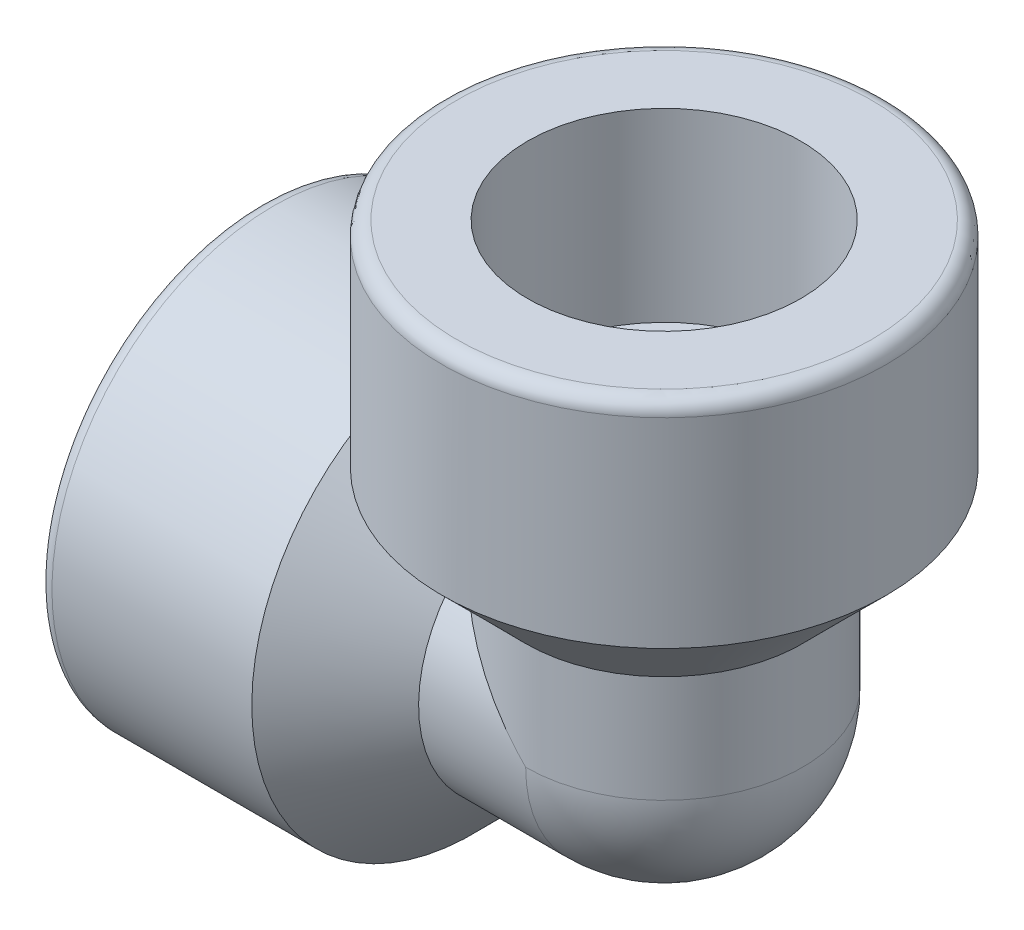
ISO-10303-21;
HEADER;
FILE_DESCRIPTION(('STEP AP214'),'2;1');
FILE_NAME('part.step','',(''),(''),'','','');
FILE_SCHEMA(('AUTOMOTIVE_DESIGN { 1 0 10303 214 1 1 1 1 }'));
ENDSEC;
DATA;
#1=APPLICATION_CONTEXT('core data for automotive mechanical design processes');
#2=APPLICATION_PROTOCOL_DEFINITION('international standard','automotive_design',2000,#1);
#3=PRODUCT_CONTEXT('',#1,'mechanical');
#4=PRODUCT('Part','Part','',(#3));
#5=PRODUCT_RELATED_PRODUCT_CATEGORY('part','',(#4));
#6=PRODUCT_DEFINITION_FORMATION('','',#4);
#7=PRODUCT_DEFINITION_CONTEXT('part definition',#1,'design');
#8=PRODUCT_DEFINITION('design','',#6,#7);
#9=PRODUCT_DEFINITION_SHAPE('','',#8);
#10=(LENGTH_UNIT() NAMED_UNIT(*) SI_UNIT(.MILLI.,.METRE.));
#11=(NAMED_UNIT(*) PLANE_ANGLE_UNIT() SI_UNIT($,.RADIAN.));
#12=(NAMED_UNIT(*) SI_UNIT($,.STERADIAN.) SOLID_ANGLE_UNIT());
#13=UNCERTAINTY_MEASURE_WITH_UNIT(LENGTH_MEASURE(1.E-05),#10,'distance_accuracy_value','');
#14=(GEOMETRIC_REPRESENTATION_CONTEXT(3) GLOBAL_UNCERTAINTY_ASSIGNED_CONTEXT((#13)) GLOBAL_UNIT_ASSIGNED_CONTEXT((#10,
#11,#12)) REPRESENTATION_CONTEXT('',''));
#15=CARTESIAN_POINT('',(0.,0.,0.));
#16=DIRECTION('',(0.,0.,1.));
#17=DIRECTION('',(1.,0.,0.));
#18=AXIS2_PLACEMENT_3D('',#15,#16,#17);
#19=CARTESIAN_POINT('',(0.,0.,0.));
#20=DIRECTION('',(1.,0.,0.));
#21=DIRECTION('',(0.,1.,0.));
#22=AXIS2_PLACEMENT_3D('',#19,#20,#21);
#23=CYLINDRICAL_SURFACE('',#22,11.557);
#24=CARTESIAN_POINT('',(-20.32635,0.,0.));
#25=DIRECTION('',(1.,0.,0.));
#26=DIRECTION('',(0.,1.,0.));
#27=AXIS2_PLACEMENT_3D('',#24,#25,#26);
#28=CIRCLE('',#27,11.557);
#29=CARTESIAN_POINT('',(-20.32635,11.557,0.));
#30=VERTEX_POINT('',#29);
#31=EDGE_CURVE('E220',#30,#30,#28,.T.);
#32=ORIENTED_EDGE('',*,*,#31,.T.);
#33=EDGE_LOOP('',(#32));
#34=FACE_BOUND('',#33,.T.);
#35=CARTESIAN_POINT('',(0.,0.,0.));
#36=DIRECTION('',(0.707106781186549,0.707106781186546,0.));
#37=DIRECTION('',(0.707106781186546,-0.707106781186549,0.));
#38=AXIS2_PLACEMENT_3D('',#35,#36,#37);
#39=ELLIPSE('',#38,16.3440661403458,11.557);
#40=CARTESIAN_POINT('',(-9.9187,9.91870000000003,-5.9315798325572));
#41=VERTEX_POINT('',#40);
#42=CARTESIAN_POINT('',(-9.9187,9.91870000000003,5.93157983255719));
#43=VERTEX_POINT('',#42);
#44=EDGE_CURVE('E84',#41,#43,#39,.T.);
#45=ORIENTED_EDGE('',*,*,#44,.F.);
#46=CARTESIAN_POINT('',(-9.9187,0.,0.));
#47=DIRECTION('',(1.,0.,0.));
#48=DIRECTION('',(0.,1.,0.));
#49=AXIS2_PLACEMENT_3D('',#46,#47,#48);
#50=CIRCLE('',#49,11.557);
#51=EDGE_CURVE('E223',#43,#41,#50,.T.);
#52=ORIENTED_EDGE('',*,*,#51,.F.);
#53=EDGE_LOOP('',(#45,#52));
#54=FACE_BOUND('',#53,.T.);
#55=ADVANCED_FACE('F70',(#34,#54),#23,.T.);
#56=CARTESIAN_POINT('',(-9.9187,0.,0.));
#57=DIRECTION('',(-1.,0.,0.));
#58=DIRECTION('',(0.,-1.,0.));
#59=AXIS2_PLACEMENT_3D('',#56,#57,#58);
#60=CONICAL_SURFACE('',#59,11.557,0.78539816339745);
#61=CARTESIAN_POINT('',(0.819150000016464,-0.819150000016481,-3.67419835772198E-06));
#62=CARTESIAN_POINT('',(0.819156269639418,-0.819156269637033,-0.0297198111189538));
#63=CARTESIAN_POINT('',(0.818341564804103,-0.818341564801315,-0.0594315481141546));
#64=CARTESIAN_POINT('',(0.815118347324884,-0.815118347322729,-0.118664130948054));
#65=CARTESIAN_POINT('',(0.812710803606909,-0.812710803605789,-0.148185081825391));
#66=CARTESIAN_POINT('',(0.806369467932354,-0.806369467932181,-0.206710310389112));
#67=CARTESIAN_POINT('',(0.802445137013405,-0.802445137013152,-0.235716647432656));
#68=CARTESIAN_POINT('',(0.793155421370217,-0.793155421369958,-0.293261594975939));
#69=CARTESIAN_POINT('',(0.78778987559809,-0.787789875597907,-0.321800152825533));
#70=CARTESIAN_POINT('',(0.770015622419365,-0.770015622419321,-0.40497565493601));
#71=CARTESIAN_POINT('',(0.755738389208463,-0.755738389208404,-0.458828652506281));
#72=CARTESIAN_POINT('',(0.722943675232962,-0.722943675232901,-0.563916811210308));
#73=CARTESIAN_POINT('',(0.704420012077311,-0.70442001207726,-0.615148020925281));
#74=CARTESIAN_POINT('',(0.665053367432766,-0.665053367432733,-0.712135568869142));
#75=CARTESIAN_POINT('',(0.644388588003857,-0.644388588003829,-0.758038171101275));
#76=CARTESIAN_POINT('',(0.60060805616887,-0.600608056168854,-0.847388735807518));
#77=CARTESIAN_POINT('',(0.577493278068745,-0.577493278068735,-0.890837663591248));
#78=CARTESIAN_POINT('',(0.504857186094345,-0.504857186094345,-1.01838017300757));
#79=CARTESIAN_POINT('',(0.452316126920789,-0.452316126920786,-1.09903670569827));
#80=CARTESIAN_POINT('',(0.34592139389584,-0.345921393895837,-1.24726431852031));
#81=CARTESIAN_POINT('',(0.292419689578086,-0.292419689578086,-1.31535670015542));
#82=CARTESIAN_POINT('',(0.182353106905065,-0.182353106905066,-1.44595214154866));
#83=CARTESIAN_POINT('',(0.125796122300498,-0.125796122300498,-1.50846859356285));
#84=CARTESIAN_POINT('',(0.00952008937551708,-0.00952008937551695,-1.62989947045198));
#85=CARTESIAN_POINT('',(-0.0502331046806778,0.0502331046806761,-1.68874785277483));
#86=CARTESIAN_POINT('',(-0.171551622961965,0.171551622961963,-1.80259962860101));
#87=CARTESIAN_POINT('',(-0.233117371607717,0.233117371607715,-1.85760211122277));
#88=CARTESIAN_POINT('',(-0.40948889915928,0.409488899159279,-2.00882392423893));
#89=CARTESIAN_POINT('',(-0.525931963692403,0.525931963692401,-2.1012195871446));
#90=CARTESIAN_POINT('',(-0.76129211758488,0.761292117584877,-2.27731269671302));
#91=CARTESIAN_POINT('',(-0.880194609565693,0.88019460956569,-2.36104985124859));
#92=CARTESIAN_POINT('',(-1.12239979641724,1.12239979641724,-2.52357003142706));
#93=CARTESIAN_POINT('',(-1.24574319585185,1.24574319585185,-2.60223109558595));
#94=CARTESIAN_POINT('',(-1.49426297891656,1.49426297891657,-2.75425245647894));
#95=CARTESIAN_POINT('',(-1.61944185711383,1.61944185711384,-2.82760453935986));
#96=CARTESIAN_POINT('',(-1.87036579396111,1.87036579396111,-2.96942187330136));
#97=CARTESIAN_POINT('',(-1.99610385663772,1.99610385663772,-3.03791198237221));
#98=CARTESIAN_POINT('',(-2.24857214089893,2.24857214089893,-3.17113933885167));
#99=CARTESIAN_POINT('',(-2.37530240672953,2.37530240672953,-3.23587641780437));
#100=CARTESIAN_POINT('',(-2.75673574200862,2.75673574200863,-3.42531229711047));
#101=CARTESIAN_POINT('',(-3.01263225618365,3.01263225618366,-3.54520854622947));
#102=CARTESIAN_POINT('',(-3.52662595753384,3.52662595753385,-3.77525417597969));
#103=CARTESIAN_POINT('',(-3.78472350373364,3.78472350373365,-3.8854019317908));
#104=CARTESIAN_POINT('',(-4.30252125377587,4.30252125377588,-4.0979206819409));
#105=CARTESIAN_POINT('',(-4.56222153228517,4.56222153228518,-4.20029131096249));
#106=CARTESIAN_POINT('',(-5.08137651785985,5.08137651785986,-4.39811172027716));
#107=CARTESIAN_POINT('',(-5.34082450501243,5.34082450501244,-4.49359694031685));
#108=CARTESIAN_POINT('',(-5.86066706418759,5.8606670641876,-4.679282766519));
#109=CARTESIAN_POINT('',(-6.12106166022858,6.1210616602286,-4.76948323758284));
#110=CARTESIAN_POINT('',(-6.90321487450145,6.90321487450147,-5.03330470259219));
#111=CARTESIAN_POINT('',(-7.42611015403457,7.42611015403458,-5.20020826852687));
#112=CARTESIAN_POINT('',(-8.09741799716953,8.09741799716955,-5.40537001663242));
#113=CARTESIAN_POINT('',(-8.24489750306851,8.24489750306854,-5.44988004888537));
#114=CARTESIAN_POINT('',(-8.54009456655671,8.54009456655673,-5.53790942822333));
#115=CARTESIAN_POINT('',(-8.68781221271166,8.68781221271168,-5.5814281840529));
#116=CARTESIAN_POINT('',(-9.54530318441663,9.54530318441666,-5.83121141271593));
#117=CARTESIAN_POINT('',(-10.2565902471213,10.2565902471213,-6.02712267853347));
#118=CARTESIAN_POINT('',(-11.6813417291102,11.6813417291103,-6.40267069692991));
#119=CARTESIAN_POINT('',(-12.3948063247732,12.3948063247732,-6.58230609295505));
#120=CARTESIAN_POINT('',(-13.8210993159182,13.8210993159183,-6.92821499503416));
#121=CARTESIAN_POINT('',(-14.5339229813901,14.5339229813901,-7.09452769389603));
#122=CARTESIAN_POINT('',(-15.9606306986241,15.9606306986242,-7.41660654573186));
#123=CARTESIAN_POINT('',(-16.6745145342454,16.6745145342454,-7.57237460900595));
#124=CARTESIAN_POINT('',(-17.388818637976,17.3888186379761,-7.72400349813519));
#125=B_SPLINE_CURVE_WITH_KNOTS('',3,(#61,#62,#63,#64,#65,#66,#67,#68,#69,#70,#71,#72,#73,#74,
#75,#76,#77,#78,#79,#80,#81,#82,#83,#84,#85,#86,#87,#88,#89,#90,#91,#92,#93,#94,#95,#96,#97,#98,
#99,#100,#101,#102,#103,#104,#105,#106,#107,#108,#109,#110,#111,#112,#113,#114,#115,#116,#117,
#118,#119,#120,#121,#122,#123,#124),.UNSPECIFIED.,.F.,.F.,(4,2,2,2,2,2,2,2,2,2,2,2,2,2,2,2,2,2,
2,2,2,2,2,2,2,2,2,2,2,2,2,4),(0.,0.0891189353022934,0.178183709224776,0.266701676384099,
0.355229539060664,0.527292916655194,0.699608410971924,0.862661040903622,1.0256490702678,
1.35382697338063,1.6589328352987,1.96328496632865,2.27208775532645,2.58096343666127,
3.1470816044846,3.71047622719119,4.28440892313418,4.85921140124149,5.43082435770936,
6.00246295136562,7.14596368571146,8.28965465434297,9.43339931275442,10.5707601215204,
11.7081499929495,13.982196056795,14.6219886402474,15.2621533375249,18.3363762022616,
21.4108550606683,24.4759291581247,27.5404464825768),.UNSPECIFIED.);
#126=CARTESIAN_POINT('',(-5.57530000000001,5.57530000000002,-4.57734146312023));
#127=VERTEX_POINT('',#126);
#128=EDGE_CURVE('E156',#127,#41,#125,.T.);
#129=ORIENTED_EDGE('',*,*,#128,.F.);
#130=CARTESIAN_POINT('',(-5.57530000000001,0.,0.));
#131=DIRECTION('',(1.,0.,0.));
#132=DIRECTION('',(0.,1.,0.));
#133=AXIS2_PLACEMENT_3D('',#130,#131,#132);
#134=CIRCLE('',#133,7.2136);
#135=CARTESIAN_POINT('',(-5.57530000000001,5.57530000000002,4.57734146312023));
#136=VERTEX_POINT('',#135);
#137=EDGE_CURVE('E129',#136,#127,#134,.T.);
#138=ORIENTED_EDGE('',*,*,#137,.F.);
#139=CARTESIAN_POINT('',(-16.0467236926674,16.0467236926675,7.43389008133731));
#140=CARTESIAN_POINT('',(-15.4158659754983,15.4158659754983,7.2947674773493));
#141=CARTESIAN_POINT('',(-14.7853953081274,14.7853953081274,7.15200573804484));
#142=CARTESIAN_POINT('',(-13.5254826259591,13.5254826259591,6.85738228857209));
#143=CARTESIAN_POINT('',(-12.8960406730512,12.8960406730512,6.70552005020596));
#144=CARTESIAN_POINT('',(-11.5709177346487,11.5709177346487,6.37397738287092));
#145=CARTESIAN_POINT('',(-10.8753904278125,10.8753904278125,6.19306148341086));
#146=CARTESIAN_POINT('',(-9.48658913164779,9.48658913164782,5.81411270705077));
#147=CARTESIAN_POINT('',(-8.79331530479206,8.79331530479209,5.61607862316274));
#148=CARTESIAN_POINT('',(-7.76918265209869,7.76918265209872,5.30571266161461));
#149=CARTESIAN_POINT('',(-7.43697980018853,7.43697980018856,5.20224682579303));
#150=CARTESIAN_POINT('',(-6.77359741677388,6.7735974167739,4.98896812587615));
#151=CARTESIAN_POINT('',(-6.44241786346557,6.44241786346559,4.87915539801272));
#152=CARTESIAN_POINT('',(-5.78141206171462,5.78141206171463,4.65191536155329));
#153=CARTESIAN_POINT('',(-5.45158562343978,5.45158562343979,4.53448916282331));
#154=CARTESIAN_POINT('',(-4.79373190953684,4.79373190953686,4.29023306572654));
#155=CARTESIAN_POINT('',(-4.46570432412057,4.46570432412058,4.16340484486831));
#156=CARTESIAN_POINT('',(-3.83430549851432,3.83430549851433,3.90677518033253));
#157=CARTESIAN_POINT('',(-3.53077560158462,3.53077560158463,3.77776355966065));
#158=CARTESIAN_POINT('',(-3.07768398647884,3.07768398647885,3.57392647165347));
#159=CARTESIAN_POINT('',(-2.92696700516343,2.92696700516344,3.5042339898758));
#160=CARTESIAN_POINT('',(-2.62649531170128,2.62649531170129,3.3608265937967));
#161=CARTESIAN_POINT('',(-2.47674056214819,2.4767405621482,3.28711183692997));
#162=CARTESIAN_POINT('',(-2.17770767410717,2.17770767410718,3.13454199198876));
#163=CARTESIAN_POINT('',(-2.02843551212798,2.02843551212798,3.05566338300983));
#164=CARTESIAN_POINT('',(-1.73150150746308,1.73150150746308,2.89208634719591));
#165=CARTESIAN_POINT('',(-1.58383949583769,1.58383949583769,2.80738853786347));
#166=CARTESIAN_POINT('',(-1.29081141706042,1.29081141706042,2.6308345101825));
#167=CARTESIAN_POINT('',(-1.14544346116887,1.14544346116887,2.5389845946275));
#168=CARTESIAN_POINT('',(-0.857809686605636,0.857809686605634,2.34607692489336));
#169=CARTESIAN_POINT('',(-0.715542679563085,0.715542679563083,2.24502277775303));
#170=CARTESIAN_POINT('',(-0.500496320398371,0.500496320398371,2.08020198777034));
#171=CARTESIAN_POINT('',(-0.426035135944628,0.42603513594463,2.02082806271226));
#172=CARTESIAN_POINT('',(-0.278956851800557,0.278956851800558,1.89785297153267));
#173=CARTESIAN_POINT('',(-0.206338113655694,0.206338113655692,1.83425575722865));
#174=CARTESIAN_POINT('',(-0.0646927160790194,0.0646927160790173,1.70300703051303));
#175=CARTESIAN_POINT('',(0.00437393228517486,-0.00437393228517498,1.6354423277687));
#176=CARTESIAN_POINT('',(0.139312572045511,-0.13931257204551,1.49417444818114));
#177=CARTESIAN_POINT('',(0.205185746611125,-0.205185746611124,1.42047357269587));
#178=CARTESIAN_POINT('',(0.303187111698328,-0.303187111698326,1.30090765077394));
#179=CARTESIAN_POINT('',(0.336961300478641,-0.336961300478638,1.25774072891856));
#180=CARTESIAN_POINT('',(0.402788029686768,-0.402788029686765,1.16885817662069));
#181=CARTESIAN_POINT('',(0.434840949493105,-0.434840949493101,1.12314311236928));
#182=CARTESIAN_POINT('',(0.496492983336969,-0.496492983336958,1.02927186169264));
#183=CARTESIAN_POINT('',(0.526111860816893,-0.526111860816876,0.981141829559768));
#184=CARTESIAN_POINT('',(0.582642764454361,-0.582642764454338,0.881709949505528));
#185=CARTESIAN_POINT('',(0.609552696063494,-0.609552696063472,0.830405696025137));
#186=CARTESIAN_POINT('',(0.661511821880377,-0.661511821880346,0.720909885490046));
#187=CARTESIAN_POINT('',(0.686320753406973,-0.686320753406931,0.662487242839695));
#188=CARTESIAN_POINT('',(0.730652514622214,-0.730652514622171,0.541837641346437));
#189=CARTESIAN_POINT('',(0.750188296336073,-0.750188296336039,0.479620472627038));
#190=CARTESIAN_POINT('',(0.774807626126006,-0.774807626125868,0.382612302394498));
#191=CARTESIAN_POINT('',(0.782320963825162,-0.782320963824967,0.349038241946078));
#192=CARTESIAN_POINT('',(0.795380463290395,-0.795380463290217,0.281132027239059));
#193=CARTESIAN_POINT('',(0.800927080496336,-0.800927080496231,0.246800050452344));
#194=CARTESIAN_POINT('',(0.809935520516454,-0.809935520515707,0.177231575886932));
#195=CARTESIAN_POINT('',(0.813375784912049,-0.813375784910579,0.141989450810301));
#196=CARTESIAN_POINT('',(0.817990699551,-0.817990699549078,0.0711695089127556));
#197=CARTESIAN_POINT('',(0.819162675493323,-0.819162675491671,0.035591345481499));
#198=CARTESIAN_POINT('',(0.819150000010504,-0.819150000010521,2.93563873496511E-06));
#199=B_SPLINE_CURVE_WITH_KNOTS('',3,(#139,#140,#141,#142,#143,#144,#145,#146,#147,#148,#149,
#150,#151,#152,#153,#154,#155,#156,#157,#158,#159,#160,#161,#162,#163,#164,#165,#166,#167,#168,
#169,#170,#171,#172,#173,#174,#175,#176,#177,#178,#179,#180,#181,#182,#183,#184,#185,#186,#187,
#188,#189,#190,#191,#192,#193,#194,#195,#196,#197,#198),.UNSPECIFIED.,.F.,.F.,(4,2,2,2,2,2,2,2,
2,2,2,2,2,2,2,2,2,2,2,2,2,2,2,2,2,2,2,2,2,4),(0.,2.70887116468708,5.41789970627266,
8.41816395385601,11.4186399202379,12.8617980673313,14.3049252494783,15.7478425283824,
17.1905029787808,18.5349776418694,19.2076975899197,19.880391226095,20.5563967767829,
21.2323307038258,21.9076755626822,22.5827568906604,22.945348067042,23.3076046142722,
23.6637315515863,24.0197255208061,24.2127896791964,24.4058111088926,24.5970669434371,
24.7884695385411,24.9925129899604,25.196050608156,25.3015969419512,25.4071188180513,
25.5137033996035,25.6204135674921),.UNSPECIFIED.);
#200=EDGE_CURVE('E91',#43,#136,#199,.T.);
#201=ORIENTED_EDGE('',*,*,#200,.F.);
#202=ORIENTED_EDGE('',*,*,#51,.T.);
#203=EDGE_LOOP('',(#129,#138,#201,#202));
#204=FACE_BOUND('',#203,.T.);
#205=ADVANCED_FACE('F162',(#204),#60,.T.);
#206=CARTESIAN_POINT('',(0.,0.,0.));
#207=DIRECTION('',(1.,0.,0.));
#208=DIRECTION('',(0.,1.,0.));
#209=AXIS2_PLACEMENT_3D('',#206,#207,#208);
#210=CYLINDRICAL_SURFACE('',#209,7.2136);
#211=CARTESIAN_POINT('',(0.,0.,0.));
#212=DIRECTION('',(0.707106781186549,0.707106781186546,0.));
#213=DIRECTION('',(0.707106781186546,-0.707106781186549,0.));
#214=AXIS2_PLACEMENT_3D('',#211,#212,#213);
#215=ELLIPSE('',#214,10.2015709535345,7.2136);
#216=CARTESIAN_POINT('',(0.,0.,-7.2136));
#217=VERTEX_POINT('',#216);
#218=EDGE_CURVE('E123',#217,#127,#215,.T.);
#219=ORIENTED_EDGE('',*,*,#218,.F.);
#220=CARTESIAN_POINT('',(0.,0.,0.));
#221=DIRECTION('',(1.,0.,0.));
#222=DIRECTION('',(0.,1.,0.));
#223=AXIS2_PLACEMENT_3D('',#220,#221,#222);
#224=CIRCLE('',#223,7.2136);
#225=CARTESIAN_POINT('',(0.,0.,7.2136));
#226=VERTEX_POINT('',#225);
#227=EDGE_CURVE('E126',#226,#217,#224,.T.);
#228=ORIENTED_EDGE('',*,*,#227,.F.);
#229=EDGE_CURVE('E112',#136,#226,#215,.T.);
#230=ORIENTED_EDGE('',*,*,#229,.F.);
#231=ORIENTED_EDGE('',*,*,#137,.T.);
#232=EDGE_LOOP('',(#219,#228,#230,#231));
#233=FACE_BOUND('',#232,.T.);
#234=ADVANCED_FACE('F127',(#233),#210,.T.);
#235=CARTESIAN_POINT('',(-21.082,-7.112,0.));
#236=DIRECTION('',(1.,0.,0.));
#237=DIRECTION('',(0.,1.,0.));
#238=AXIS2_PLACEMENT_3D('',#235,#236,#237);
#239=PLANE('',#238);
#240=CARTESIAN_POINT('',(-21.082,0.,0.));
#241=DIRECTION('',(1.,0.,0.));
#242=DIRECTION('',(0.,1.,0.));
#243=AXIS2_PLACEMENT_3D('',#240,#241,#242);
#244=CIRCLE('',#243,10.80135);
#245=CARTESIAN_POINT('',(-21.082,10.80135,0.));
#246=VERTEX_POINT('',#245);
#247=EDGE_CURVE('E78',#246,#246,#244,.T.);
#248=ORIENTED_EDGE('',*,*,#247,.F.);
#249=EDGE_LOOP('',(#248));
#250=FACE_BOUND('',#249,.T.);
#251=CARTESIAN_POINT('',(-21.082,0.,0.));
#252=DIRECTION('',(1.,0.,0.));
#253=DIRECTION('',(0.,1.,0.));
#254=AXIS2_PLACEMENT_3D('',#251,#252,#253);
#255=CIRCLE('',#254,7.112);
#256=CARTESIAN_POINT('',(-21.082,7.112,0.));
#257=VERTEX_POINT('',#256);
#258=EDGE_CURVE('E236',#257,#257,#255,.T.);
#259=ORIENTED_EDGE('',*,*,#258,.T.);
#260=EDGE_LOOP('',(#259));
#261=FACE_BOUND('',#260,.T.);
#262=ADVANCED_FACE('F72',(#250,#261),#239,.F.);
#263=CARTESIAN_POINT('',(-20.32635,0.,0.));
#264=DIRECTION('',(1.,0.,0.));
#265=DIRECTION('',(0.,1.,0.));
#266=AXIS2_PLACEMENT_3D('',#263,#264,#265);
#267=TOROIDAL_SURFACE('',#266,10.80135,0.755650000000001);
#268=ORIENTED_EDGE('',*,*,#31,.F.);
#269=EDGE_LOOP('',(#268));
#270=FACE_BOUND('',#269,.T.);
#271=ORIENTED_EDGE('',*,*,#247,.T.);
#272=EDGE_LOOP('',(#271));
#273=FACE_BOUND('',#272,.T.);
#274=ADVANCED_FACE('F201',(#270,#273),#267,.T.);
#275=CARTESIAN_POINT('',(0.,0.,0.));
#276=DIRECTION('',(1.,0.,0.));
#277=DIRECTION('',(0.,1.,0.));
#278=AXIS2_PLACEMENT_3D('',#275,#276,#277);
#279=CYLINDRICAL_SURFACE('',#278,4.191);
#280=CARTESIAN_POINT('',(0.,0.,0.));
#281=DIRECTION('',(0.707106781186549,0.707106781186546,0.));
#282=DIRECTION('',(0.707106781186546,-0.707106781186549,0.));
#283=AXIS2_PLACEMENT_3D('',#280,#281,#282);
#284=ELLIPSE('',#283,5.92696903990563,4.191);
#285=CARTESIAN_POINT('',(0.,0.,-4.191));
#286=VERTEX_POINT('',#285);
#287=CARTESIAN_POINT('',(0.,0.,4.191));
#288=VERTEX_POINT('',#287);
#289=EDGE_CURVE('E12',#286,#288,#284,.T.);
#290=ORIENTED_EDGE('',*,*,#289,.T.);
#291=CARTESIAN_POINT('',(0.,0.,0.));
#292=DIRECTION('',(1.,0.,0.));
#293=DIRECTION('',(0.,1.,0.));
#294=AXIS2_PLACEMENT_3D('',#291,#292,#293);
#295=CIRCLE('',#294,4.191);
#296=EDGE_CURVE('E130',#288,#286,#295,.T.);
#297=ORIENTED_EDGE('',*,*,#296,.T.);
#298=EDGE_LOOP('',(#290,#297));
#299=FACE_BOUND('',#298,.T.);
#300=CARTESIAN_POINT('',(-11.43,0.,0.));
#301=DIRECTION('',(1.,0.,0.));
#302=DIRECTION('',(0.,1.,0.));
#303=AXIS2_PLACEMENT_3D('',#300,#301,#302);
#304=CIRCLE('',#303,4.191);
#305=CARTESIAN_POINT('',(-11.43,4.19099999999999,0.));
#306=VERTEX_POINT('',#305);
#307=EDGE_CURVE('E230',#306,#306,#304,.T.);
#308=ORIENTED_EDGE('',*,*,#307,.F.);
#309=EDGE_LOOP('',(#308));
#310=FACE_BOUND('',#309,.T.);
#311=ADVANCED_FACE('F198',(#299,#310),#279,.F.);
#312=CARTESIAN_POINT('',(-11.43,-7.112,0.));
#313=DIRECTION('',(1.,0.,0.));
#314=DIRECTION('',(0.,1.,0.));
#315=AXIS2_PLACEMENT_3D('',#312,#313,#314);
#316=PLANE('',#315);
#317=CARTESIAN_POINT('',(-11.43,0.,0.));
#318=DIRECTION('',(1.,0.,0.));
#319=DIRECTION('',(0.,1.,0.));
#320=AXIS2_PLACEMENT_3D('',#317,#318,#319);
#321=CIRCLE('',#320,7.112);
#322=CARTESIAN_POINT('',(-11.43,7.11199999999999,0.));
#323=VERTEX_POINT('',#322);
#324=EDGE_CURVE('E233',#323,#323,#321,.T.);
#325=ORIENTED_EDGE('',*,*,#324,.F.);
#326=EDGE_LOOP('',(#325));
#327=FACE_BOUND('',#326,.T.);
#328=ORIENTED_EDGE('',*,*,#307,.T.);
#329=EDGE_LOOP('',(#328));
#330=FACE_BOUND('',#329,.T.);
#331=ADVANCED_FACE('F194',(#327,#330),#316,.F.);
#332=CARTESIAN_POINT('',(0.,0.,0.));
#333=DIRECTION('',(1.,0.,0.));
#334=DIRECTION('',(0.,1.,0.));
#335=AXIS2_PLACEMENT_3D('',#332,#333,#334);
#336=CYLINDRICAL_SURFACE('',#335,7.112);
#337=ORIENTED_EDGE('',*,*,#258,.F.);
#338=EDGE_LOOP('',(#337));
#339=FACE_BOUND('',#338,.T.);
#340=ORIENTED_EDGE('',*,*,#324,.T.);
#341=EDGE_LOOP('',(#340));
#342=FACE_BOUND('',#341,.T.);
#343=ADVANCED_FACE('F190',(#339,#342),#336,.F.);
#344=CARTESIAN_POINT('',(0.,21.082,0.));
#345=DIRECTION('',(0.,-1.,0.));
#346=DIRECTION('',(1.,0.,0.));
#347=AXIS2_PLACEMENT_3D('',#344,#345,#346);
#348=CYLINDRICAL_SURFACE('',#347,4.191);
#349=ORIENTED_EDGE('',*,*,#289,.F.);
#350=CARTESIAN_POINT('',(0.,0.,0.));
#351=DIRECTION('',(0.,-1.,0.));
#352=DIRECTION('',(1.,0.,0.));
#353=AXIS2_PLACEMENT_3D('',#350,#351,#352);
#354=CIRCLE('',#353,4.191);
#355=EDGE_CURVE('E133',#286,#288,#354,.T.);
#356=ORIENTED_EDGE('',*,*,#355,.T.);
#357=EDGE_LOOP('',(#349,#356));
#358=FACE_BOUND('',#357,.T.);
#359=CARTESIAN_POINT('',(0.,11.43,0.));
#360=DIRECTION('',(0.,-1.,0.));
#361=DIRECTION('',(1.,0.,0.));
#362=AXIS2_PLACEMENT_3D('',#359,#360,#361);
#363=CIRCLE('',#362,4.191);
#364=CARTESIAN_POINT('',(4.19100000000003,11.43,0.));
#365=VERTEX_POINT('',#364);
#366=EDGE_CURVE('E138',#365,#365,#363,.T.);
#367=ORIENTED_EDGE('',*,*,#366,.F.);
#368=EDGE_LOOP('',(#367));
#369=FACE_BOUND('',#368,.T.);
#370=ADVANCED_FACE('F177',(#358,#369),#348,.F.);
#371=CARTESIAN_POINT('',(0.,0.,0.));
#372=DIRECTION('',(0.,-1.,0.));
#373=DIRECTION('',(1.,0.,0.));
#374=AXIS2_PLACEMENT_3D('',#371,#372,#373);
#375=CYLINDRICAL_SURFACE('',#374,11.557);
#376=CARTESIAN_POINT('',(0.,20.32635,0.));
#377=DIRECTION('',(0.,-1.,0.));
#378=DIRECTION('',(1.,0.,0.));
#379=AXIS2_PLACEMENT_3D('',#376,#377,#378);
#380=CIRCLE('',#379,11.557);
#381=CARTESIAN_POINT('',(11.5570000000001,20.32635,0.));
#382=VERTEX_POINT('',#381);
#383=EDGE_CURVE('E144',#382,#382,#380,.T.);
#384=ORIENTED_EDGE('',*,*,#383,.T.);
#385=EDGE_LOOP('',(#384));
#386=FACE_BOUND('',#385,.T.);
#387=CARTESIAN_POINT('',(0.,9.9187,0.));
#388=DIRECTION('',(0.,-1.,0.));
#389=DIRECTION('',(1.,0.,0.));
#390=AXIS2_PLACEMENT_3D('',#387,#388,#389);
#391=CIRCLE('',#390,11.557);
#392=EDGE_CURVE('E135',#41,#43,#391,.T.);
#393=ORIENTED_EDGE('',*,*,#392,.F.);
#394=ORIENTED_EDGE('',*,*,#44,.T.);
#395=EDGE_LOOP('',(#393,#394));
#396=FACE_BOUND('',#395,.T.);
#397=ADVANCED_FACE('F171',(#386,#396),#375,.T.);
#398=CARTESIAN_POINT('',(0.,9.9187,0.));
#399=DIRECTION('',(0.,1.,0.));
#400=DIRECTION('',(-1.,0.,0.));
#401=AXIS2_PLACEMENT_3D('',#398,#399,#400);
#402=CONICAL_SURFACE('',#401,11.557,0.78539816339745);
#403=CARTESIAN_POINT('',(0.,5.57530000000001,0.));
#404=DIRECTION('',(0.,-1.,0.));
#405=DIRECTION('',(1.,0.,0.));
#406=AXIS2_PLACEMENT_3D('',#403,#404,#405);
#407=CIRCLE('',#406,7.2136);
#408=EDGE_CURVE('E120',#127,#136,#407,.T.);
#409=ORIENTED_EDGE('',*,*,#408,.F.);
#410=ORIENTED_EDGE('',*,*,#128,.T.);
#411=ORIENTED_EDGE('',*,*,#392,.T.);
#412=ORIENTED_EDGE('',*,*,#200,.T.);
#413=EDGE_LOOP('',(#409,#410,#411,#412));
#414=FACE_BOUND('',#413,.T.);
#415=ADVANCED_FACE('F166',(#414),#402,.T.);
#416=CARTESIAN_POINT('',(0.,0.,0.));
#417=DIRECTION('',(0.,-1.,0.));
#418=DIRECTION('',(1.,0.,0.));
#419=AXIS2_PLACEMENT_3D('',#416,#417,#418);
#420=CYLINDRICAL_SURFACE('',#419,7.2136);
#421=CARTESIAN_POINT('',(0.,0.,0.));
#422=DIRECTION('',(0.,-1.,0.));
#423=DIRECTION('',(1.,0.,0.));
#424=AXIS2_PLACEMENT_3D('',#421,#422,#423);
#425=CIRCLE('',#424,7.2136);
#426=EDGE_CURVE('E117',#217,#226,#425,.T.);
#427=ORIENTED_EDGE('',*,*,#426,.F.);
#428=ORIENTED_EDGE('',*,*,#218,.T.);
#429=ORIENTED_EDGE('',*,*,#408,.T.);
#430=ORIENTED_EDGE('',*,*,#229,.T.);
#431=EDGE_LOOP('',(#427,#428,#429,#430));
#432=FACE_BOUND('',#431,.T.);
#433=ADVANCED_FACE('F114',(#432),#420,.T.);
#434=CARTESIAN_POINT('',(-7.11199999999993,21.082,0.));
#435=DIRECTION('',(0.,-1.,0.));
#436=DIRECTION('',(1.,0.,0.));
#437=AXIS2_PLACEMENT_3D('',#434,#435,#436);
#438=PLANE('',#437);
#439=CARTESIAN_POINT('',(0.,21.082,0.));
#440=DIRECTION('',(0.,-1.,0.));
#441=DIRECTION('',(1.,0.,0.));
#442=AXIS2_PLACEMENT_3D('',#439,#440,#441);
#443=CIRCLE('',#442,10.80135);
#444=CARTESIAN_POINT('',(10.8013500000001,21.082,0.));
#445=VERTEX_POINT('',#444);
#446=EDGE_CURVE('E124',#445,#445,#443,.T.);
#447=ORIENTED_EDGE('',*,*,#446,.F.);
#448=EDGE_LOOP('',(#447));
#449=FACE_BOUND('',#448,.T.);
#450=CARTESIAN_POINT('',(0.,21.082,0.));
#451=DIRECTION('',(0.,-1.,0.));
#452=DIRECTION('',(1.,0.,0.));
#453=AXIS2_PLACEMENT_3D('',#450,#451,#452);
#454=CIRCLE('',#453,7.112);
#455=CARTESIAN_POINT('',(7.11200000000007,21.082,0.));
#456=VERTEX_POINT('',#455);
#457=EDGE_CURVE('E257',#456,#456,#454,.T.);
#458=ORIENTED_EDGE('',*,*,#457,.T.);
#459=EDGE_LOOP('',(#458));
#460=FACE_BOUND('',#459,.T.);
#461=ADVANCED_FACE('F183',(#449,#460),#438,.F.);
#462=CARTESIAN_POINT('',(0.,20.32635,0.));
#463=DIRECTION('',(0.,-1.,0.));
#464=DIRECTION('',(1.,0.,0.));
#465=AXIS2_PLACEMENT_3D('',#462,#463,#464);
#466=TOROIDAL_SURFACE('',#465,10.80135,0.755650000000001);
#467=ORIENTED_EDGE('',*,*,#383,.F.);
#468=EDGE_LOOP('',(#467));
#469=FACE_BOUND('',#468,.T.);
#470=ORIENTED_EDGE('',*,*,#446,.T.);
#471=EDGE_LOOP('',(#470));
#472=FACE_BOUND('',#471,.T.);
#473=ADVANCED_FACE('F179',(#469,#472),#466,.T.);
#474=CARTESIAN_POINT('',(-7.11199999999996,11.43,0.));
#475=DIRECTION('',(0.,-1.,0.));
#476=DIRECTION('',(1.,0.,0.));
#477=AXIS2_PLACEMENT_3D('',#474,#475,#476);
#478=PLANE('',#477);
#479=CARTESIAN_POINT('',(0.,11.43,0.));
#480=DIRECTION('',(0.,-1.,0.));
#481=DIRECTION('',(1.,0.,0.));
#482=AXIS2_PLACEMENT_3D('',#479,#480,#481);
#483=CIRCLE('',#482,7.112);
#484=CARTESIAN_POINT('',(7.11200000000003,11.43,0.));
#485=VERTEX_POINT('',#484);
#486=EDGE_CURVE('E255',#485,#485,#483,.T.);
#487=ORIENTED_EDGE('',*,*,#486,.F.);
#488=EDGE_LOOP('',(#487));
#489=FACE_BOUND('',#488,.T.);
#490=ORIENTED_EDGE('',*,*,#366,.T.);
#491=EDGE_LOOP('',(#490));
#492=FACE_BOUND('',#491,.T.);
#493=ADVANCED_FACE('F182',(#489,#492),#478,.F.);
#494=CARTESIAN_POINT('',(0.,0.,0.));
#495=DIRECTION('',(0.,-1.,0.));
#496=DIRECTION('',(1.,0.,0.));
#497=AXIS2_PLACEMENT_3D('',#494,#495,#496);
#498=CYLINDRICAL_SURFACE('',#497,7.112);
#499=ORIENTED_EDGE('',*,*,#457,.F.);
#500=EDGE_LOOP('',(#499));
#501=FACE_BOUND('',#500,.T.);
#502=ORIENTED_EDGE('',*,*,#486,.T.);
#503=EDGE_LOOP('',(#502));
#504=FACE_BOUND('',#503,.T.);
#505=ADVANCED_FACE('F264',(#501,#504),#498,.F.);
#506=CARTESIAN_POINT('',(0.,0.,0.));
#507=DIRECTION('',(0.,0.,-1.));
#508=DIRECTION('',(-1.,0.,0.));
#509=AXIS2_PLACEMENT_3D('',#506,#507,#508);
#510=SPHERICAL_SURFACE('',#509,7.2136);
#511=ORIENTED_EDGE('',*,*,#227,.T.);
#512=ORIENTED_EDGE('',*,*,#426,.T.);
#513=EDGE_LOOP('',(#511,#512));
#514=FACE_BOUND('',#513,.T.);
#515=ADVANCED_FACE('F132',(#514),#510,.T.);
#516=CARTESIAN_POINT('',(0.,0.,0.));
#517=DIRECTION('',(0.,0.,-1.));
#518=DIRECTION('',(-1.,0.,0.));
#519=AXIS2_PLACEMENT_3D('',#516,#517,#518);
#520=SPHERICAL_SURFACE('',#519,4.191);
#521=ORIENTED_EDGE('',*,*,#296,.F.);
#522=ORIENTED_EDGE('',*,*,#355,.F.);
#523=EDGE_LOOP('',(#521,#522));
#524=FACE_BOUND('',#523,.T.);
#525=ADVANCED_FACE('F250',(#524),#520,.F.);
#526=CLOSED_SHELL('',(#55,#205,#234,#262,#274,#311,#331,#343,#370,#397,#415,#433,#461,#473,#493,
#505,#515,#525));
#527=MANIFOLD_SOLID_BREP('B2',#526);
#528=ADVANCED_BREP_SHAPE_REPRESENTATION('',(#18,#527),#14);
#529=SHAPE_DEFINITION_REPRESENTATION(#9,#528);
ENDSEC;
END-ISO-10303-21;
